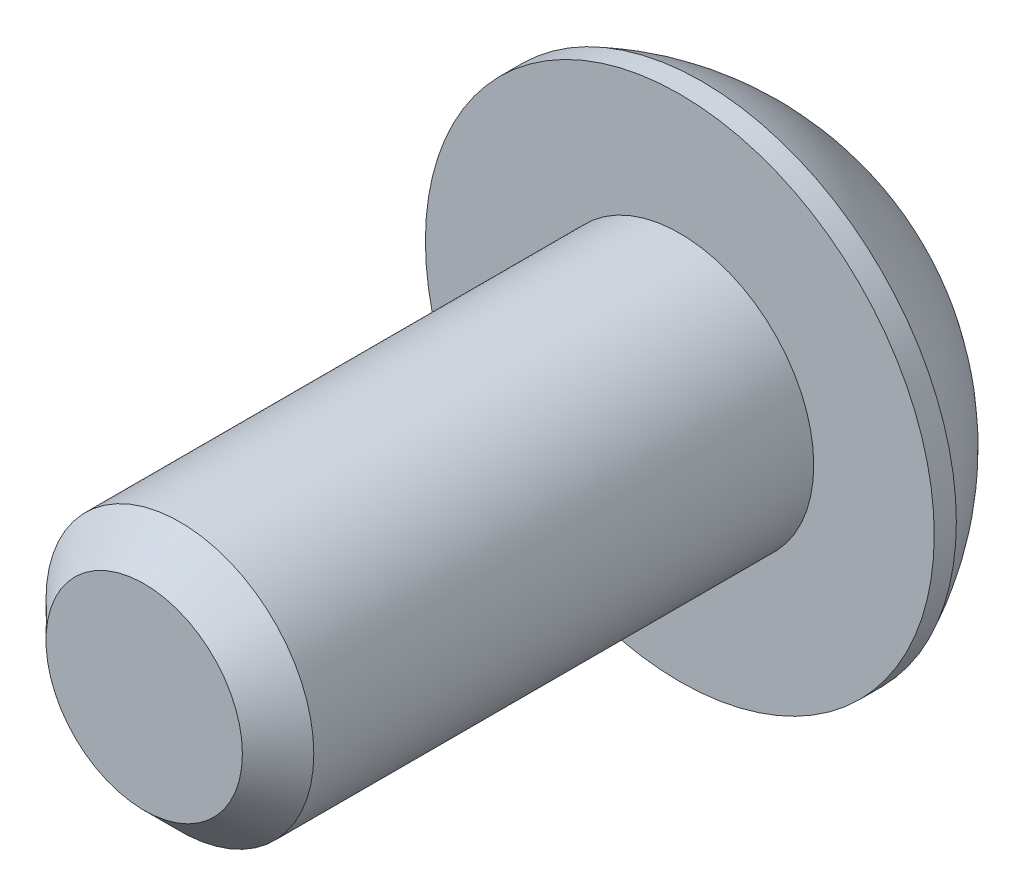
ISO-10303-21;
HEADER;
FILE_DESCRIPTION(('STEP AP214'),'2;1');
FILE_NAME('part.step','',(''),(''),'','','');
FILE_SCHEMA(('AUTOMOTIVE_DESIGN { 1 0 10303 214 1 1 1 1 }'));
ENDSEC;
DATA;
#1=APPLICATION_CONTEXT('core data for automotive mechanical design processes');
#2=APPLICATION_PROTOCOL_DEFINITION('international standard','automotive_design',2000,#1);
#3=PRODUCT_CONTEXT('',#1,'mechanical');
#4=PRODUCT('Part','Part','',(#3));
#5=PRODUCT_RELATED_PRODUCT_CATEGORY('part','',(#4));
#6=PRODUCT_DEFINITION_FORMATION('','',#4);
#7=PRODUCT_DEFINITION_CONTEXT('part definition',#1,'design');
#8=PRODUCT_DEFINITION('design','',#6,#7);
#9=PRODUCT_DEFINITION_SHAPE('','',#8);
#10=(LENGTH_UNIT() NAMED_UNIT(*) SI_UNIT(.MILLI.,.METRE.));
#11=(NAMED_UNIT(*) PLANE_ANGLE_UNIT() SI_UNIT($,.RADIAN.));
#12=(NAMED_UNIT(*) SI_UNIT($,.STERADIAN.) SOLID_ANGLE_UNIT());
#13=UNCERTAINTY_MEASURE_WITH_UNIT(LENGTH_MEASURE(1.E-05),#10,'distance_accuracy_value','');
#14=(GEOMETRIC_REPRESENTATION_CONTEXT(3) GLOBAL_UNCERTAINTY_ASSIGNED_CONTEXT((#13)) GLOBAL_UNIT_ASSIGNED_CONTEXT((#10,
#11,#12)) REPRESENTATION_CONTEXT('',''));
#15=CARTESIAN_POINT('',(0.,0.,0.));
#16=DIRECTION('',(0.,0.,1.));
#17=DIRECTION('',(1.,0.,0.));
#18=AXIS2_PLACEMENT_3D('',#15,#16,#17);
#19=CARTESIAN_POINT('',(0.,0.,-3.825));
#20=DIRECTION('',(0.,0.,1.));
#21=DIRECTION('',(-1.,0.,0.));
#22=AXIS2_PLACEMENT_3D('',#19,#20,#21);
#23=PLANE('',#22);
#24=CARTESIAN_POINT('',(0.,0.,-3.825));
#25=DIRECTION('',(0.,0.,1.));
#26=DIRECTION('',(1.,0.,0.));
#27=AXIS2_PLACEMENT_3D('',#24,#25,#26);
#28=CIRCLE('',#27,1.15470053837925);
#29=CARTESIAN_POINT('',(-1.,0.577350269189626,-3.825));
#30=VERTEX_POINT('',#29);
#31=CARTESIAN_POINT('',(-1.,-0.577350269189626,-3.825));
#32=VERTEX_POINT('',#31);
#33=EDGE_CURVE('E133',#30,#32,#28,.T.);
#34=ORIENTED_EDGE('',*,*,#33,.T.);
#35=CARTESIAN_POINT('',(0.,-1.15470053837925,-3.825));
#36=VERTEX_POINT('',#35);
#37=EDGE_CURVE('E144',#32,#36,#28,.T.);
#38=ORIENTED_EDGE('',*,*,#37,.T.);
#39=CARTESIAN_POINT('',(1.,-0.577350269189626,-3.825));
#40=VERTEX_POINT('',#39);
#41=EDGE_CURVE('E143',#36,#40,#28,.T.);
#42=ORIENTED_EDGE('',*,*,#41,.T.);
#43=CARTESIAN_POINT('',(1.,0.577350269189626,-3.825));
#44=VERTEX_POINT('',#43);
#45=EDGE_CURVE('E138',#40,#44,#28,.T.);
#46=ORIENTED_EDGE('',*,*,#45,.T.);
#47=CARTESIAN_POINT('',(0.,1.15470053837925,-3.825));
#48=VERTEX_POINT('',#47);
#49=EDGE_CURVE('E119',#44,#48,#28,.T.);
#50=ORIENTED_EDGE('',*,*,#49,.T.);
#51=EDGE_CURVE('E128',#48,#30,#28,.T.);
#52=ORIENTED_EDGE('',*,*,#51,.T.);
#53=EDGE_LOOP('',(#34,#38,#42,#46,#50,#52));
#54=FACE_BOUND('',#53,.T.);
#55=CARTESIAN_POINT('',(0.,0.,-3.825));
#56=DIRECTION('',(0.,0.,1.));
#57=DIRECTION('',(1.,0.,0.));
#58=AXIS2_PLACEMENT_3D('',#55,#56,#57);
#59=CIRCLE('',#58,1.5);
#60=CARTESIAN_POINT('',(0.,1.5,-3.825));
#61=VERTEX_POINT('',#60);
#62=EDGE_CURVE('E56',#61,#61,#59,.T.);
#63=ORIENTED_EDGE('',*,*,#62,.F.);
#64=EDGE_LOOP('',(#63));
#65=FACE_BOUND('',#64,.T.);
#66=ADVANCED_FACE('F43',(#54,#65),#23,.F.);
#67=CARTESIAN_POINT('',(0.,0.,-1.03016711229946));
#68=DIRECTION('',(0.,0.,-1.));
#69=DIRECTION('',(0.,1.,0.));
#70=AXIS2_PLACEMENT_3D('',#67,#68,#69);
#71=SPHERICAL_SURFACE('',#70,3.17192226735973);
#72=CARTESIAN_POINT('',(0.,0.,-2.4225));
#73=DIRECTION('',(0.,0.,1.));
#74=DIRECTION('',(1.,0.,0.));
#75=AXIS2_PLACEMENT_3D('',#72,#73,#74);
#76=CIRCLE('',#75,2.85);
#77=CARTESIAN_POINT('',(0.,2.85,-2.4225));
#78=VERTEX_POINT('',#77);
#79=EDGE_CURVE('E241',#78,#78,#76,.T.);
#80=CARTESIAN_POINT('',(0.,1.5,-3.825));
#81=CARTESIAN_POINT('',(0.,1.5181600798921,-3.81525343052663));
#82=CARTESIAN_POINT('',(0.,1.5362251374298,-3.80532981527615));
#83=CARTESIAN_POINT('',(0.,1.57215840256594,-3.78513236887069));
#84=CARTESIAN_POINT('',(0.,1.59002661016438,-3.77485853771571));
#85=CARTESIAN_POINT('',(0.,1.6255593701915,-3.75396453515098));
#86=CARTESIAN_POINT('',(0.,1.64322392262019,-3.74334436374123));
#87=CARTESIAN_POINT('',(0.,1.67834266450262,-3.72176172357303));
#88=CARTESIAN_POINT('',(0.,1.69579685395635,-3.71079925481458));
#89=CARTESIAN_POINT('',(0.,1.73048823664554,-3.68853618336439));
#90=CARTESIAN_POINT('',(0.,1.74772542988098,-3.67723558067265));
#91=CARTESIAN_POINT('',(0.,1.78197627078176,-3.65430053581285));
#92=CARTESIAN_POINT('',(0.,1.79898991844709,-3.64266609364478));
#93=CARTESIAN_POINT('',(0.,1.83278720341135,-3.61906779045309));
#94=CARTESIAN_POINT('',(0.,1.84957084071028,-3.60710392942946));
#95=CARTESIAN_POINT('',(0.,1.88290172764636,-3.58285133450125));
#96=CARTESIAN_POINT('',(0.,1.8994489772835,-3.57056260059666));
#97=CARTESIAN_POINT('',(0.,1.93230080139369,-3.54566492927458));
#98=CARTESIAN_POINT('',(0.,1.94860537586673,-3.53305599185708));
#99=CARTESIAN_POINT('',(0.,1.98096565436365,-3.50752270455889));
#100=CARTESIAN_POINT('',(0.,1.99702135838753,-3.49459835467819));
#101=CARTESIAN_POINT('',(0.,2.02887779526296,-3.46843915334777));
#102=CARTESIAN_POINT('',(0.,2.04467852811452,-3.45520430189805));
#103=CARTESIAN_POINT('',(0.,2.07601901880464,-3.42842912630669));
#104=CARTESIAN_POINT('',(0.,2.09155877664321,-3.41488880216506));
#105=CARTESIAN_POINT('',(0.,2.12237141262985,-3.38750782613789));
#106=CARTESIAN_POINT('',(0.,2.13764429077791,-3.37366717425237));
#107=CARTESIAN_POINT('',(0.,2.16791736411296,-3.34569080180173));
#108=CARTESIAN_POINT('',(0.,2.18291755929993,-3.33155508123663));
#109=CARTESIAN_POINT('',(0.,2.21263956705414,-3.30299394260905));
#110=CARTESIAN_POINT('',(0.,2.22736137962139,-3.28856852454658));
#111=CARTESIAN_POINT('',(0.,2.2565210282552,-3.25943347218353));
#112=CARTESIAN_POINT('',(0.,2.27095886432177,-3.24472383788295));
#113=CARTESIAN_POINT('',(0.,2.2995450739765,-3.21502594229721));
#114=CARTESIAN_POINT('',(0.,2.31369344756465,-3.20003768101205));
#115=CARTESIAN_POINT('',(0.,2.34169535627252,-3.16978822658124));
#116=CARTESIAN_POINT('',(0.,2.35554889139223,-3.15452703343559));
#117=CARTESIAN_POINT('',(0.,2.38295585920366,-3.12373751411442));
#118=CARTESIAN_POINT('',(0.,2.39650929189537,-3.1082091879389));
#119=CARTESIAN_POINT('',(0.,2.42331090492182,-3.07689130289176));
#120=CARTESIAN_POINT('',(0.,2.43655908525656,-3.06110174402014));
#121=CARTESIAN_POINT('',(0.,2.46274515962755,-3.02926739317577));
#122=CARTESIAN_POINT('',(0.,2.47568305366379,-3.01322260120302));
#123=CARTESIAN_POINT('',(0.,2.5012436393965,-2.98088388073287));
#124=CARTESIAN_POINT('',(0.,2.51386633109298,-2.96458995223548));
#125=CARTESIAN_POINT('',(0.,2.53879171587278,-2.9317591499574));
#126=CARTESIAN_POINT('',(0.,2.55109440895612,-2.91522227617672));
#127=CARTESIAN_POINT('',(0.,2.57537512182785,-2.88191186688636));
#128=CARTESIAN_POINT('',(0.,2.58735314161625,-2.8651383313767));
#129=CARTESIAN_POINT('',(0.,2.61097995657956,-2.83136097210575));
#130=CARTESIAN_POINT('',(0.,2.62262875175448,-2.81435714834448));
#131=CARTESIAN_POINT('',(0.,2.64559269128198,-2.78012567355775));
#132=CARTESIAN_POINT('',(0.,2.65690783563458,-2.76289802253229));
#133=CARTESIAN_POINT('',(0.,2.67920017403639,-2.72822543922701));
#134=CARTESIAN_POINT('',(0.,2.69017736808561,-2.71078050694718));
#135=CARTESIAN_POINT('',(0.,2.711789634999,-2.67567998980005));
#136=CARTESIAN_POINT('',(0.,2.72242470786316,-2.65802440493275));
#137=CARTESIAN_POINT('',(0.,2.74334869082117,-2.62250929096058));
#138=CARTESIAN_POINT('',(0.,2.75363760091502,-2.60464976185571));
#139=CARTESIAN_POINT('',(0.,2.77386535089241,-2.56873354659176));
#140=CARTESIAN_POINT('',(0.,2.78380419077596,-2.55067686043268));
#141=CARTESIAN_POINT('',(0.,2.80332801615778,-2.51437318815589));
#142=CARTESIAN_POINT('',(0.,2.81291300165605,-2.49612620203818));
#143=CARTESIAN_POINT('',(0.,2.83172550494215,-2.4594488779161));
#144=CARTESIAN_POINT('',(0.,2.84095302272998,-2.44101853991173));
#145=CARTESIAN_POINT('',(0.,2.85,-2.4225));
#146=B_SPLINE_CURVE_WITH_KNOTS('',3,(#80,#81,#82,#83,#84,#85,#86,#87,#88,#89,#90,#91,#92,#93,
#94,#95,#96,#97,#98,#99,#100,#101,#102,#103,#104,#105,#106,#107,#108,#109,#110,#111,#112,#113,
#114,#115,#116,#117,#118,#119,#120,#121,#122,#123,#124,#125,#126,#127,#128,#129,#130,#131,#132,
#133,#134,#135,#136,#137,#138,#139,#140,#141,#142,#143,#144,#145),.UNSPECIFIED.,.F.,.F.,(4,2,2,
2,2,2,2,2,2,2,2,2,2,2,2,2,2,2,2,2,2,2,2,2,2,2,2,2,2,2,2,2,4),(0.,0.0618298941826979,
0.123659788365397,0.185489682548095,0.247319576730793,0.309149470913491,0.370979365096189,
0.432809259278888,0.494639153461586,0.556469047644284,0.618298941826983,0.680128836009681,
0.741958730192379,0.803788624375077,0.865618518557776,0.927448412740474,0.989278306923172,
1.05110820110587,1.11293809528857,1.17476798947127,1.23659788365397,1.29842777783666,
1.36025767201936,1.42208756620206,1.48391746038476,1.54574735456746,1.60757724875015,
1.66940714293285,1.73123703711555,1.79306693129825,1.85489682548095,1.91672671966365,
1.97855661384634),.UNSPECIFIED.);
#147=EDGE_CURVE('BSEAM229',#61,#78,#146,.T.);
#148=ORIENTED_EDGE('',*,*,#62,.T.);
#149=ORIENTED_EDGE('',*,*,#79,.F.);
#150=ORIENTED_EDGE('',*,*,#147,.T.);
#151=ORIENTED_EDGE('',*,*,#147,.F.);
#152=EDGE_LOOP('',(#148,#150,#149,#151));
#153=FACE_BOUND('',#152,.T.);
#154=ADVANCED_FACE('F229',(#153),#71,.T.);
#155=CARTESIAN_POINT('',(0.,0.,-3.825));
#156=DIRECTION('',(0.,0.,-1.));
#157=DIRECTION('',(1.,0.,0.));
#158=AXIS2_PLACEMENT_3D('',#155,#156,#157);
#159=CYLINDRICAL_SURFACE('',#158,2.85);
#160=ORIENTED_EDGE('',*,*,#79,.T.);
#161=EDGE_LOOP('',(#160));
#162=FACE_BOUND('',#161,.T.);
#163=CARTESIAN_POINT('',(0.,0.,-2.175));
#164=DIRECTION('',(0.,0.,1.));
#165=DIRECTION('',(1.,0.,0.));
#166=AXIS2_PLACEMENT_3D('',#163,#164,#165);
#167=CIRCLE('',#166,2.85);
#168=CARTESIAN_POINT('',(2.85,0.,-2.175));
#169=VERTEX_POINT('',#168);
#170=EDGE_CURVE('E242',#169,#169,#167,.T.);
#171=ORIENTED_EDGE('',*,*,#170,.F.);
#172=EDGE_LOOP('',(#171));
#173=FACE_BOUND('',#172,.T.);
#174=ADVANCED_FACE('F226',(#162,#173),#159,.T.);
#175=CARTESIAN_POINT('',(0.,1.5,-2.175));
#176=DIRECTION('',(0.,0.,-1.));
#177=DIRECTION('',(1.,0.,0.));
#178=AXIS2_PLACEMENT_3D('',#175,#176,#177);
#179=PLANE('',#178);
#180=ORIENTED_EDGE('',*,*,#170,.T.);
#181=EDGE_LOOP('',(#180));
#182=FACE_BOUND('',#181,.T.);
#183=CARTESIAN_POINT('',(0.,0.,-2.175));
#184=DIRECTION('',(0.,0.,1.));
#185=DIRECTION('',(1.,0.,0.));
#186=AXIS2_PLACEMENT_3D('',#183,#184,#185);
#187=CIRCLE('',#186,1.5);
#188=CARTESIAN_POINT('',(1.5,0.,-2.175));
#189=VERTEX_POINT('',#188);
#190=EDGE_CURVE('E245',#189,#189,#187,.T.);
#191=ORIENTED_EDGE('',*,*,#190,.F.);
#192=EDGE_LOOP('',(#191));
#193=FACE_BOUND('',#192,.T.);
#194=ADVANCED_FACE('F222',(#182,#193),#179,.F.);
#195=CARTESIAN_POINT('',(0.,0.,-3.825));
#196=DIRECTION('',(0.,0.,-1.));
#197=DIRECTION('',(1.,0.,0.));
#198=AXIS2_PLACEMENT_3D('',#195,#196,#197);
#199=CYLINDRICAL_SURFACE('',#198,1.5);
#200=ORIENTED_EDGE('',*,*,#190,.T.);
#201=EDGE_LOOP('',(#200));
#202=FACE_BOUND('',#201,.T.);
#203=CARTESIAN_POINT('',(0.,0.,3.425));
#204=DIRECTION('',(0.,0.,1.));
#205=DIRECTION('',(1.,0.,0.));
#206=AXIS2_PLACEMENT_3D('',#203,#204,#205);
#207=CIRCLE('',#206,1.5);
#208=CARTESIAN_POINT('',(1.5,0.,3.425));
#209=VERTEX_POINT('',#208);
#210=EDGE_CURVE('E250',#209,#209,#207,.T.);
#211=ORIENTED_EDGE('',*,*,#210,.F.);
#212=EDGE_LOOP('',(#211));
#213=FACE_BOUND('',#212,.T.);
#214=ADVANCED_FACE('F218',(#202,#213),#199,.T.);
#215=CARTESIAN_POINT('',(0.,0.,3.825));
#216=DIRECTION('',(0.,0.,-1.));
#217=DIRECTION('',(1.,0.,0.));
#218=AXIS2_PLACEMENT_3D('',#215,#216,#217);
#219=CONICAL_SURFACE('',#218,1.1,0.785398163397444);
#220=ORIENTED_EDGE('',*,*,#210,.T.);
#221=EDGE_LOOP('',(#220));
#222=FACE_BOUND('',#221,.T.);
#223=CARTESIAN_POINT('',(0.,0.,3.825));
#224=DIRECTION('',(0.,0.,1.));
#225=DIRECTION('',(1.,0.,0.));
#226=AXIS2_PLACEMENT_3D('',#223,#224,#225);
#227=CIRCLE('',#226,1.1);
#228=CARTESIAN_POINT('',(1.1,0.,3.825));
#229=VERTEX_POINT('',#228);
#230=EDGE_CURVE('E253',#229,#229,#227,.T.);
#231=ORIENTED_EDGE('',*,*,#230,.F.);
#232=EDGE_LOOP('',(#231));
#233=FACE_BOUND('',#232,.T.);
#234=ADVANCED_FACE('F214',(#222,#233),#219,.T.);
#235=CARTESIAN_POINT('',(0.,0.,3.825));
#236=DIRECTION('',(0.,0.,-1.));
#237=DIRECTION('',(1.,0.,0.));
#238=AXIS2_PLACEMENT_3D('',#235,#236,#237);
#239=PLANE('',#238);
#240=ORIENTED_EDGE('',*,*,#230,.T.);
#241=EDGE_LOOP('',(#240));
#242=FACE_BOUND('',#241,.T.);
#243=ADVANCED_FACE('F211',(#242),#239,.F.);
#244=CARTESIAN_POINT('',(0.,0.,-3.825));
#245=DIRECTION('',(0.,0.,-1.));
#246=DIRECTION('',(1.,0.,0.));
#247=AXIS2_PLACEMENT_3D('',#244,#245,#246);
#248=CONICAL_SURFACE('',#247,1.15470053837925,0.78539816339745);
#249=ORIENTED_EDGE('',*,*,#51,.F.);
#250=CARTESIAN_POINT('',(0.000200000000000047,1.15481600843309,-3.82511548737261));
#251=CARTESIAN_POINT('',(-0.0341825950071806,1.13496520795026,-3.80527793082573));
#252=CARTESIAN_POINT('',(-0.0691401181398248,1.11478247255942,-3.78660502063889));
#253=CARTESIAN_POINT('',(-0.14042280295609,1.07362739529219,-3.75241474272316));
#254=CARTESIAN_POINT('',(-0.176754750528984,1.0526511355808,-3.73691640902346));
#255=CARTESIAN_POINT('',(-0.250016613803311,1.01035337909803,-3.71036730714226));
#256=CARTESIAN_POINT('',(-0.286927851445414,0.989042666109241,-3.69924977399692));
#257=CARTESIAN_POINT('',(-0.361562729310859,0.945952199282692,-3.68211986577618));
#258=CARTESIAN_POINT('',(-0.399284088108636,0.924173762626597,-3.67609469746667));
#259=CARTESIAN_POINT('',(-0.464292198417934,0.886641312640015,-3.67066055496749));
#260=CARTESIAN_POINT('',(-0.491494371528172,0.870936130672276,-3.66985693831673));
#261=CARTESIAN_POINT('',(-0.545846040669112,0.839556179862849,-3.67120669941689));
#262=CARTESIAN_POINT('',(-0.572995523754876,0.823881418494924,-3.6733607295472));
#263=CARTESIAN_POINT('',(-0.65405627732696,0.777080970599367,-3.68411697212847));
#264=CARTESIAN_POINT('',(-0.707564140978427,0.746188191116431,-3.69701455641535));
#265=CARTESIAN_POINT('',(-0.801476065143432,0.69196811641965,-3.72814073060218));
#266=CARTESIAN_POINT('',(-0.842320523671834,0.668386557293372,-3.74473779770184));
#267=CARTESIAN_POINT('',(-0.922409637381944,0.622147085933682,-3.78212492468529));
#268=CARTESIAN_POINT('',(-0.961659010870438,0.599486449584576,-3.8029013418174));
#269=CARTESIAN_POINT('',(-1.0002,0.577234799135789,-3.82511548737261));
#270=B_SPLINE_CURVE_WITH_KNOTS('',3,(#250,#251,#252,#253,#254,#255,#256,#257,#258,#259,#260,
#261,#262,#263,#264,#265,#266,#267,#268,#269),.UNSPECIFIED.,.F.,.F.,(4,2,2,2,2,2,2,2,2,4),(0.,
0.133237676828559,0.26725222983449,0.3991370762693,0.530689603280768,0.624814864263846,
0.718960890149133,0.907306626112098,1.05710100361789,1.20641411519286),.UNSPECIFIED.);
#271=EDGE_CURVE('E11',#48,#30,#270,.T.);
#272=ORIENTED_EDGE('',*,*,#271,.T.);
#273=EDGE_LOOP('',(#249,#272));
#274=FACE_BOUND('',#273,.T.);
#275=ADVANCED_FACE('F129',(#274),#248,.F.);
#276=ORIENTED_EDGE('',*,*,#33,.F.);
#277=CARTESIAN_POINT('',(-1.,-1.15147208646462,-4.19538567751386));
#278=CARTESIAN_POINT('',(-1.,-1.12343447988552,-4.17421991987371));
#279=CARTESIAN_POINT('',(-1.,-1.09524064850697,-4.15326169217591));
#280=CARTESIAN_POINT('',(-1.,-1.03847715644376,-4.11184602223562));
#281=CARTESIAN_POINT('',(-1.,-1.00990740382975,-4.09138870612366));
#282=CARTESIAN_POINT('',(-1.,-0.923120894333476,-4.03060479495451));
#283=CARTESIAN_POINT('',(-1.,-0.864253173759059,-3.9911922289614));
#284=CARTESIAN_POINT('',(-1.,-0.740809858258045,-3.9138206642002));
#285=CARTESIAN_POINT('',(-1.,-0.676100255137807,-3.87607303911434));
#286=CARTESIAN_POINT('',(-1.,-0.543448939049124,-3.80702458755129));
#287=CARTESIAN_POINT('',(-1.,-0.475519112027779,-3.77570202784686));
#288=CARTESIAN_POINT('',(-1.,-0.373555850333528,-3.73738177888379));
#289=CARTESIAN_POINT('',(-1.,-0.341031989670907,-3.72638359164215));
#290=CARTESIAN_POINT('',(-1.,-0.275199079052293,-3.70699834214736));
#291=CARTESIAN_POINT('',(-1.,-0.241889975173933,-3.6986114597767));
#292=CARTESIAN_POINT('',(-1.,-0.175247517042992,-3.68502522071901));
#293=CARTESIAN_POINT('',(-1.,-0.141925568218175,-3.67977079076797));
#294=CARTESIAN_POINT('',(-1.,-0.0749144362322788,-3.67254868657089));
#295=CARTESIAN_POINT('',(-1.,-0.0412251978501616,-3.67058151361051));
#296=CARTESIAN_POINT('',(-1.,0.0249580992634211,-3.67008319839316));
#297=CARTESIAN_POINT('',(-1.,0.0574512826460393,-3.67143026788863));
#298=CARTESIAN_POINT('',(-1.,0.122148505701867,-3.67721648449898));
#299=CARTESIAN_POINT('',(-1.,0.154352610132926,-3.68165492066153));
#300=CARTESIAN_POINT('',(-1.,0.21879989886764,-3.6934568301452));
#301=CARTESIAN_POINT('',(-1.,0.251033743268953,-3.70087054103851));
#302=CARTESIAN_POINT('',(-1.,0.314797132354919,-3.71822894249867));
#303=CARTESIAN_POINT('',(-1.,0.346326735731004,-3.72817342128883));
#304=CARTESIAN_POINT('',(-1.,0.445594187730205,-3.76322348255433));
#305=CARTESIAN_POINT('',(-1.,0.511919139476036,-3.79232085835672));
#306=CARTESIAN_POINT('',(-1.,0.641453244657532,-3.8570153296865));
#307=CARTESIAN_POINT('',(-1.,0.704650133126344,-3.89263577671524));
#308=CARTESIAN_POINT('',(-1.,0.825428490174986,-3.96612390134693));
#309=CARTESIAN_POINT('',(-1.,0.883132947867684,-4.00379194713546));
#310=CARTESIAN_POINT('',(-1.,0.968148853704564,-4.06202285294316));
#311=CARTESIAN_POINT('',(-1.,0.996120570380284,-4.08163847576285));
#312=CARTESIAN_POINT('',(-1.,1.05168177729901,-4.12138851706127));
#313=CARTESIAN_POINT('',(-1.,1.079271369977,-4.14152279219883));
#314=CARTESIAN_POINT('',(-1.,1.10670185346329,-4.16187211907297));
#315=B_SPLINE_CURVE_WITH_KNOTS('',3,(#277,#278,#279,#280,#281,#282,#283,#284,#285,#286,#287,
#288,#289,#290,#291,#292,#293,#294,#295,#296,#297,#298,#299,#300,#301,#302,#303,#304,#305,#306,
#307,#308,#309,#310,#311,#312,#313,#314),.UNSPECIFIED.,.F.,.F.,(4,2,2,2,2,2,2,2,2,2,2,2,2,2,2,2,
2,2,4),(0.,0.105386459083291,0.210799187330124,0.423233611565468,0.647793540908503,
0.871580877738609,0.974493074181421,1.07741235827201,1.17846428203205,1.27953161415762,
1.3769408673961,1.47432772585408,1.57343322804293,1.67253043972851,1.88917353996827,
2.10660791038813,2.31323734249843,2.41572589232044,2.51818641476503),.UNSPECIFIED.);
#316=EDGE_CURVE('E139',#30,#32,#315,.F.);
#317=ORIENTED_EDGE('',*,*,#316,.T.);
#318=EDGE_LOOP('',(#276,#317));
#319=FACE_BOUND('',#318,.T.);
#320=ADVANCED_FACE('F149',(#319),#248,.F.);
#321=ORIENTED_EDGE('',*,*,#37,.F.);
#322=CARTESIAN_POINT('',(-1.0002,-0.577234799135788,-3.82511548737261));
#323=CARTESIAN_POINT('',(-0.965817404992819,-0.597085599618621,-3.80527793082573));
#324=CARTESIAN_POINT('',(-0.930859881860175,-0.617268335009456,-3.78660502063889));
#325=CARTESIAN_POINT('',(-0.85957719704391,-0.658423412276686,-3.75241474272316));
#326=CARTESIAN_POINT('',(-0.823245249471016,-0.67939967198808,-3.73691640902346));
#327=CARTESIAN_POINT('',(-0.749983386196689,-0.721697428470846,-3.71036730714226));
#328=CARTESIAN_POINT('',(-0.713072148554586,-0.743008141459636,-3.69924977399692));
#329=CARTESIAN_POINT('',(-0.638437270689141,-0.786098608286186,-3.68211986577618));
#330=CARTESIAN_POINT('',(-0.600715911891364,-0.807877044942281,-3.67609469746667));
#331=CARTESIAN_POINT('',(-0.535707801582067,-0.845409494928862,-3.67066055496749));
#332=CARTESIAN_POINT('',(-0.508505628471828,-0.861114676896601,-3.66985693831673));
#333=CARTESIAN_POINT('',(-0.454153959330888,-0.892494627706028,-3.67120669941689));
#334=CARTESIAN_POINT('',(-0.427004476245125,-0.908169389073953,-3.6733607295472));
#335=CARTESIAN_POINT('',(-0.34594372267304,-0.95496983696951,-3.68411697212847));
#336=CARTESIAN_POINT('',(-0.292435859021573,-0.985862616452447,-3.69701455641535));
#337=CARTESIAN_POINT('',(-0.198523934856569,-1.04008269114923,-3.72814073060218));
#338=CARTESIAN_POINT('',(-0.157679476328166,-1.06366425027551,-3.74473779770184));
#339=CARTESIAN_POINT('',(-0.0775903626180565,-1.1099037216352,-3.78212492468529));
#340=CARTESIAN_POINT('',(-0.0383409891295625,-1.1325643579843,-3.8029013418174));
#341=CARTESIAN_POINT('',(0.000199999999999785,-1.15481600843309,-3.82511548737261));
#342=B_SPLINE_CURVE_WITH_KNOTS('',3,(#322,#323,#324,#325,#326,#327,#328,#329,#330,#331,#332,
#333,#334,#335,#336,#337,#338,#339,#340,#341),.UNSPECIFIED.,.F.,.F.,(4,2,2,2,2,2,2,2,2,4),(0.,
0.133237676828559,0.26725222983449,0.3991370762693,0.530689603280768,0.624814864263846,
0.718960890149133,0.907306626112097,1.05710100361789,1.20641411519286),.UNSPECIFIED.);
#343=EDGE_CURVE('E141',#32,#36,#342,.T.);
#344=ORIENTED_EDGE('',*,*,#343,.T.);
#345=EDGE_LOOP('',(#321,#344));
#346=FACE_BOUND('',#345,.T.);
#347=ADVANCED_FACE('F153',(#346),#248,.F.);
#348=ORIENTED_EDGE('',*,*,#41,.F.);
#349=CARTESIAN_POINT('',(-0.000200000000000145,-1.15481600843309,-3.82511548737261));
#350=CARTESIAN_POINT('',(0.0341825950071805,-1.13496520795026,-3.80527793082573));
#351=CARTESIAN_POINT('',(0.0691401181398246,-1.11478247255942,-3.78660502063889));
#352=CARTESIAN_POINT('',(0.140422802956089,-1.07362739529219,-3.75241474272316));
#353=CARTESIAN_POINT('',(0.176754750528984,-1.0526511355808,-3.73691640902346));
#354=CARTESIAN_POINT('',(0.250016613803311,-1.01035337909803,-3.71036730714226));
#355=CARTESIAN_POINT('',(0.286927851445414,-0.98904266610924,-3.69924977399692));
#356=CARTESIAN_POINT('',(0.361562729310859,-0.945952199282691,-3.68211986577618));
#357=CARTESIAN_POINT('',(0.399284088108636,-0.924173762626596,-3.67609469746667));
#358=CARTESIAN_POINT('',(0.464292198417933,-0.886641312640014,-3.67066055496749));
#359=CARTESIAN_POINT('',(0.491494371528172,-0.870936130672275,-3.66985693831673));
#360=CARTESIAN_POINT('',(0.545846040669112,-0.839556179862848,-3.67120669941689));
#361=CARTESIAN_POINT('',(0.572995523754876,-0.823881418494923,-3.6733607295472));
#362=CARTESIAN_POINT('',(0.65405627732696,-0.777080970599366,-3.68411697212847));
#363=CARTESIAN_POINT('',(0.707564140978427,-0.74618819111643,-3.69701455641535));
#364=CARTESIAN_POINT('',(0.801476065143431,-0.691968116419649,-3.72814073060218));
#365=CARTESIAN_POINT('',(0.842320523671834,-0.668386557293371,-3.74473779770184));
#366=CARTESIAN_POINT('',(0.922409637381944,-0.622147085933681,-3.78212492468529));
#367=CARTESIAN_POINT('',(0.961659010870438,-0.599486449584575,-3.8029013418174));
#368=CARTESIAN_POINT('',(1.0002,-0.577234799135788,-3.82511548737261));
#369=B_SPLINE_CURVE_WITH_KNOTS('',3,(#349,#350,#351,#352,#353,#354,#355,#356,#357,#358,#359,
#360,#361,#362,#363,#364,#365,#366,#367,#368),.UNSPECIFIED.,.F.,.F.,(4,2,2,2,2,2,2,2,2,4),(0.,
0.133237676828559,0.26725222983449,0.3991370762693,0.530689603280768,0.624814864263846,
0.718960890149133,0.907306626112097,1.05710100361789,1.20641411519286),.UNSPECIFIED.);
#370=EDGE_CURVE('E156',#36,#40,#369,.T.);
#371=ORIENTED_EDGE('',*,*,#370,.T.);
#372=EDGE_LOOP('',(#348,#371));
#373=FACE_BOUND('',#372,.T.);
#374=ADVANCED_FACE('F160',(#373),#248,.F.);
#375=ORIENTED_EDGE('',*,*,#45,.F.);
#376=CARTESIAN_POINT('',(1.,-1.15147208663215,-4.19538567764035));
#377=CARTESIAN_POINT('',(1.,-1.12343448004835,-4.17421991999533));
#378=CARTESIAN_POINT('',(1.,-1.09524064866509,-4.15326169229266));
#379=CARTESIAN_POINT('',(1.,-1.0384771565924,-4.11184602234267));
#380=CARTESIAN_POINT('',(1.,-1.00990740397363,-4.09138870622588));
#381=CARTESIAN_POINT('',(1.,-0.923120894462775,-4.03060479504212));
#382=CARTESIAN_POINT('',(1.,-0.864253173878445,-3.99119222903932));
#383=CARTESIAN_POINT('',(1.,-0.740809858355811,-3.91382066425819));
#384=CARTESIAN_POINT('',(1.,-0.676100255223808,-3.87607303916216));
#385=CARTESIAN_POINT('',(1.,-0.543448939110597,-3.80702458758025));
#386=CARTESIAN_POINT('',(1.,-0.475519112076495,-3.77570202786713));
#387=CARTESIAN_POINT('',(1.,-0.373555850372648,-3.7373817788976));
#388=CARTESIAN_POINT('',(1.,-0.341031989714046,-3.72638359165621));
#389=CARTESIAN_POINT('',(1.,-0.275199079103601,-3.70699834216111));
#390=CARTESIAN_POINT('',(1.,-0.241889975229392,-3.69861145978989));
#391=CARTESIAN_POINT('',(1.,-0.175247517106615,-3.68502522073014));
#392=CARTESIAN_POINT('',(1.,-0.141925568285808,-3.67977079077761));
#393=CARTESIAN_POINT('',(1.,-0.0749144363078009,-3.67254868657667));
#394=CARTESIAN_POINT('',(1.,-0.0412251979295626,-3.6705815136139));
#395=CARTESIAN_POINT('',(1.,0.0249580991768645,-3.67008319839111));
#396=CARTESIAN_POINT('',(1.,0.057451282556196,-3.67143026788357));
#397=CARTESIAN_POINT('',(1.,0.122148505605779,-3.67721648448742));
#398=CARTESIAN_POINT('',(1.,0.154352610033881,-3.68165492064648));
#399=CARTESIAN_POINT('',(1.,0.218799898762755,-3.69345683012285));
#400=CARTESIAN_POINT('',(1.,0.251033743161196,-3.70087054101231));
#401=CARTESIAN_POINT('',(1.,0.314797132241694,-3.71822894246471));
#402=CARTESIAN_POINT('',(1.,0.346326735615184,-3.72817342125094));
#403=CARTESIAN_POINT('',(1.,0.445594187589164,-3.76322348249794));
#404=CARTESIAN_POINT('',(1.,0.511919139313635,-3.7923208582833));
#405=CARTESIAN_POINT('',(1.,0.641453244454049,-3.85701532957714));
#406=CARTESIAN_POINT('',(1.,0.704650132903151,-3.89263577658696));
#407=CARTESIAN_POINT('',(1.,0.825428489916356,-3.96612390118245));
#408=CARTESIAN_POINT('',(1.,0.883132947593201,-4.00379194695385));
#409=CARTESIAN_POINT('',(1.,0.968148853406642,-4.06202285273595));
#410=CARTESIAN_POINT('',(1.,0.99612057007466,-4.08163847554718));
#411=CARTESIAN_POINT('',(1.,1.05168177697804,-4.12138851682867));
#412=CARTESIAN_POINT('',(1.,1.07927136964838,-4.14152279195778));
#413=CARTESIAN_POINT('',(1.,1.10670185312703,-4.16187211882347));
#414=B_SPLINE_CURVE_WITH_KNOTS('',3,(#376,#377,#378,#379,#380,#381,#382,#383,#384,#385,#386,
#387,#388,#389,#390,#391,#392,#393,#394,#395,#396,#397,#398,#399,#400,#401,#402,#403,#404,#405,
#406,#407,#408,#409,#410,#411,#412,#413),.UNSPECIFIED.,.F.,.F.,(4,2,2,2,2,2,2,2,2,2,2,2,2,2,2,2,
2,2,4),(0.,0.10538645910335,0.210799187370248,0.423233611646473,0.64779354103535,
0.871580877910865,0.974493074342054,1.07741235842104,1.17846428216995,1.27953161428439,
1.37694086751269,1.47432772596047,1.57343322813835,1.67253043981296,1.88917353997386,
2.10660791031433,2.31323734235672,2.41572589214523,2.51818641455632),.UNSPECIFIED.);
#415=EDGE_CURVE('E121',#40,#44,#414,.T.);
#416=ORIENTED_EDGE('',*,*,#415,.T.);
#417=EDGE_LOOP('',(#375,#416));
#418=FACE_BOUND('',#417,.T.);
#419=ADVANCED_FACE('F163',(#418),#248,.F.);
#420=ORIENTED_EDGE('',*,*,#49,.F.);
#421=CARTESIAN_POINT('',(1.0002,0.577234799135789,-3.82511548737261));
#422=CARTESIAN_POINT('',(0.965817404992819,0.597085599618622,-3.80527793082573));
#423=CARTESIAN_POINT('',(0.930859881860175,0.617268335009457,-3.78660502063889));
#424=CARTESIAN_POINT('',(0.859577197043911,0.658423412276686,-3.75241474272316));
#425=CARTESIAN_POINT('',(0.823245249471016,0.67939967198808,-3.73691640902346));
#426=CARTESIAN_POINT('',(0.749983386196689,0.721697428470847,-3.71036730714226));
#427=CARTESIAN_POINT('',(0.713072148554586,0.743008141459637,-3.69924977399693));
#428=CARTESIAN_POINT('',(0.638437270689141,0.786098608286186,-3.68211986577618));
#429=CARTESIAN_POINT('',(0.600715911891365,0.807877044942281,-3.67609469746667));
#430=CARTESIAN_POINT('',(0.535707801582067,0.845409494928863,-3.67066055496749));
#431=CARTESIAN_POINT('',(0.508505628471829,0.861114676896602,-3.66985693831673));
#432=CARTESIAN_POINT('',(0.454153959330889,0.892494627706029,-3.67120669941689));
#433=CARTESIAN_POINT('',(0.427004476245125,0.908169389073954,-3.6733607295472));
#434=CARTESIAN_POINT('',(0.34594372267304,0.954969836969511,-3.68411697212847));
#435=CARTESIAN_POINT('',(0.292435859021573,0.985862616452447,-3.69701455641535));
#436=CARTESIAN_POINT('',(0.198523934856569,1.04008269114923,-3.72814073060218));
#437=CARTESIAN_POINT('',(0.157679476328166,1.06366425027551,-3.74473779770184));
#438=CARTESIAN_POINT('',(0.0775903626180566,1.1099037216352,-3.78212492468529));
#439=CARTESIAN_POINT('',(0.0383409891295624,1.1325643579843,-3.8029013418174));
#440=CARTESIAN_POINT('',(-0.000199999999999812,1.15481600843309,-3.82511548737261));
#441=B_SPLINE_CURVE_WITH_KNOTS('',3,(#421,#422,#423,#424,#425,#426,#427,#428,#429,#430,#431,
#432,#433,#434,#435,#436,#437,#438,#439,#440),.UNSPECIFIED.,.F.,.F.,(4,2,2,2,2,2,2,2,2,4),(0.,
0.133237676828559,0.267252229834489,0.399137076269299,0.530689603280767,0.624814864263845,
0.718960890149132,0.907306626112096,1.05710100361789,1.20641411519286),.UNSPECIFIED.);
#442=EDGE_CURVE('E104',#44,#48,#441,.T.);
#443=ORIENTED_EDGE('',*,*,#442,.T.);
#444=EDGE_LOOP('',(#420,#443));
#445=FACE_BOUND('',#444,.T.);
#446=ADVANCED_FACE('F117',(#445),#248,.F.);
#447=CARTESIAN_POINT('',(0.,0.,-2.425));
#448=DIRECTION('',(0.,0.,-1.));
#449=DIRECTION('',(1.,0.,0.));
#450=AXIS2_PLACEMENT_3D('',#447,#448,#449);
#451=PLANE('',#450);
#452=DIRECTION('',(-0.866025403784439,0.5,0.));
#453=VECTOR('',#452,1.);
#454=CARTESIAN_POINT('',(1.,0.577350269189626,-2.425));
#455=LINE('',#454,#453);
#456=CARTESIAN_POINT('',(1.,0.577350269189626,-2.425));
#457=VERTEX_POINT('',#456);
#458=CARTESIAN_POINT('',(0.,1.15470053837925,-2.425));
#459=VERTEX_POINT('',#458);
#460=EDGE_CURVE('E107',#457,#459,#455,.T.);
#461=ORIENTED_EDGE('',*,*,#460,.F.);
#462=DIRECTION('',(0.,1.,0.));
#463=VECTOR('',#462,1.);
#464=CARTESIAN_POINT('',(1.,-0.577350269189626,-2.425));
#465=LINE('',#464,#463);
#466=CARTESIAN_POINT('',(1.,-0.577350269189626,-2.425));
#467=VERTEX_POINT('',#466);
#468=EDGE_CURVE('E113',#467,#457,#465,.T.);
#469=ORIENTED_EDGE('',*,*,#468,.F.);
#470=DIRECTION('',(0.866025403784439,0.5,0.));
#471=VECTOR('',#470,1.);
#472=CARTESIAN_POINT('',(0.,-1.15470053837925,-2.425));
#473=LINE('',#472,#471);
#474=CARTESIAN_POINT('',(0.,-1.15470053837925,-2.425));
#475=VERTEX_POINT('',#474);
#476=EDGE_CURVE('E264',#475,#467,#473,.T.);
#477=ORIENTED_EDGE('',*,*,#476,.F.);
#478=DIRECTION('',(0.866025403784438,-0.5,0.));
#479=VECTOR('',#478,1.);
#480=CARTESIAN_POINT('',(-1.,-0.577350269189625,-2.425));
#481=LINE('',#480,#479);
#482=CARTESIAN_POINT('',(-1.,-0.577350269189625,-2.425));
#483=VERTEX_POINT('',#482);
#484=EDGE_CURVE('E266',#483,#475,#481,.T.);
#485=ORIENTED_EDGE('',*,*,#484,.F.);
#486=DIRECTION('',(0.,-1.,0.));
#487=VECTOR('',#486,1.);
#488=CARTESIAN_POINT('',(-1.,0.577350269189626,-2.425));
#489=LINE('',#488,#487);
#490=CARTESIAN_POINT('',(-1.,0.577350269189626,-2.425));
#491=VERTEX_POINT('',#490);
#492=EDGE_CURVE('E269',#491,#483,#489,.T.);
#493=ORIENTED_EDGE('',*,*,#492,.F.);
#494=DIRECTION('',(-0.866025403784439,-0.5,0.));
#495=VECTOR('',#494,1.);
#496=CARTESIAN_POINT('',(0.,1.15470053837925,-2.425));
#497=LINE('',#496,#495);
#498=EDGE_CURVE('E272',#459,#491,#497,.T.);
#499=ORIENTED_EDGE('',*,*,#498,.F.);
#500=EDGE_LOOP('',(#461,#469,#477,#485,#493,#499));
#501=FACE_BOUND('',#500,.T.);
#502=ADVANCED_FACE('F187',(#501),#451,.T.);
#503=CARTESIAN_POINT('',(0.,1.15470053837925,-2.425));
#504=DIRECTION('',(-0.5,0.866025403784439,0.));
#505=DIRECTION('',(-0.866025403784439,-0.5,0.));
#506=AXIS2_PLACEMENT_3D('',#503,#504,#505);
#507=PLANE('',#506);
#508=DIRECTION('',(0.,0.,-1.));
#509=VECTOR('',#508,1.);
#510=CARTESIAN_POINT('',(0.,1.15470053837925,-2.425));
#511=LINE('',#510,#509);
#512=EDGE_CURVE('E101',#459,#48,#511,.T.);
#513=ORIENTED_EDGE('',*,*,#512,.F.);
#514=ORIENTED_EDGE('',*,*,#498,.T.);
#515=DIRECTION('',(0.,0.,-1.));
#516=VECTOR('',#515,1.);
#517=CARTESIAN_POINT('',(-1.,0.577350269189626,-2.425));
#518=LINE('',#517,#516);
#519=EDGE_CURVE('E112',#491,#30,#518,.T.);
#520=ORIENTED_EDGE('',*,*,#519,.T.);
#521=ORIENTED_EDGE('',*,*,#271,.F.);
#522=EDGE_LOOP('',(#513,#514,#520,#521));
#523=FACE_BOUND('',#522,.T.);
#524=ADVANCED_FACE('F124',(#523),#507,.F.);
#525=CARTESIAN_POINT('',(-1.,0.577350269189626,-2.425));
#526=DIRECTION('',(-1.,0.,0.));
#527=DIRECTION('',(0.,0.,-1.));
#528=AXIS2_PLACEMENT_3D('',#525,#526,#527);
#529=PLANE('',#528);
#530=ORIENTED_EDGE('',*,*,#519,.F.);
#531=ORIENTED_EDGE('',*,*,#492,.T.);
#532=DIRECTION('',(0.,0.,-1.));
#533=VECTOR('',#532,1.);
#534=CARTESIAN_POINT('',(-1.,-0.577350269189625,-2.425));
#535=LINE('',#534,#533);
#536=EDGE_CURVE('E257',#483,#32,#535,.T.);
#537=ORIENTED_EDGE('',*,*,#536,.T.);
#538=ORIENTED_EDGE('',*,*,#316,.F.);
#539=EDGE_LOOP('',(#530,#531,#537,#538));
#540=FACE_BOUND('',#539,.T.);
#541=ADVANCED_FACE('F195',(#540),#529,.F.);
#542=CARTESIAN_POINT('',(-1.,-0.577350269189625,-2.425));
#543=DIRECTION('',(-0.5,-0.866025403784438,0.));
#544=DIRECTION('',(0.866025403784439,-0.5,0.));
#545=AXIS2_PLACEMENT_3D('',#542,#543,#544);
#546=PLANE('',#545);
#547=ORIENTED_EDGE('',*,*,#536,.F.);
#548=ORIENTED_EDGE('',*,*,#484,.T.);
#549=DIRECTION('',(0.,0.,-1.));
#550=VECTOR('',#549,1.);
#551=CARTESIAN_POINT('',(0.,-1.15470053837925,-2.425));
#552=LINE('',#551,#550);
#553=EDGE_CURVE('E259',#475,#36,#552,.T.);
#554=ORIENTED_EDGE('',*,*,#553,.T.);
#555=ORIENTED_EDGE('',*,*,#343,.F.);
#556=EDGE_LOOP('',(#547,#548,#554,#555));
#557=FACE_BOUND('',#556,.T.);
#558=ADVANCED_FACE('F191',(#557),#546,.F.);
#559=CARTESIAN_POINT('',(0.,-1.15470053837925,-2.425));
#560=DIRECTION('',(0.5,-0.866025403784439,0.));
#561=DIRECTION('',(0.866025403784439,0.5,0.));
#562=AXIS2_PLACEMENT_3D('',#559,#560,#561);
#563=PLANE('',#562);
#564=ORIENTED_EDGE('',*,*,#553,.F.);
#565=ORIENTED_EDGE('',*,*,#476,.T.);
#566=DIRECTION('',(0.,0.,-1.));
#567=VECTOR('',#566,1.);
#568=CARTESIAN_POINT('',(1.,-0.577350269189626,-2.425));
#569=LINE('',#568,#567);
#570=EDGE_CURVE('E71',#467,#40,#569,.T.);
#571=ORIENTED_EDGE('',*,*,#570,.T.);
#572=ORIENTED_EDGE('',*,*,#370,.F.);
#573=EDGE_LOOP('',(#564,#565,#571,#572));
#574=FACE_BOUND('',#573,.T.);
#575=ADVANCED_FACE('F186',(#574),#563,.F.);
#576=CARTESIAN_POINT('',(1.,-0.577350269189626,-2.425));
#577=DIRECTION('',(1.,0.,0.));
#578=DIRECTION('',(0.,1.,0.));
#579=AXIS2_PLACEMENT_3D('',#576,#577,#578);
#580=PLANE('',#579);
#581=ORIENTED_EDGE('',*,*,#570,.F.);
#582=ORIENTED_EDGE('',*,*,#468,.T.);
#583=DIRECTION('',(0.,0.,-1.));
#584=VECTOR('',#583,1.);
#585=CARTESIAN_POINT('',(1.,0.577350269189626,-2.425));
#586=LINE('',#585,#584);
#587=EDGE_CURVE('E63',#457,#44,#586,.T.);
#588=ORIENTED_EDGE('',*,*,#587,.T.);
#589=ORIENTED_EDGE('',*,*,#415,.F.);
#590=EDGE_LOOP('',(#581,#582,#588,#589));
#591=FACE_BOUND('',#590,.T.);
#592=ADVANCED_FACE('F183',(#591),#580,.F.);
#593=CARTESIAN_POINT('',(1.,0.577350269189626,-2.425));
#594=DIRECTION('',(0.5,0.866025403784439,0.));
#595=DIRECTION('',(-0.866025403784439,0.5,0.));
#596=AXIS2_PLACEMENT_3D('',#593,#594,#595);
#597=PLANE('',#596);
#598=ORIENTED_EDGE('',*,*,#587,.F.);
#599=ORIENTED_EDGE('',*,*,#460,.T.);
#600=ORIENTED_EDGE('',*,*,#512,.T.);
#601=ORIENTED_EDGE('',*,*,#442,.F.);
#602=EDGE_LOOP('',(#598,#599,#600,#601));
#603=FACE_BOUND('',#602,.T.);
#604=ADVANCED_FACE('F103',(#603),#597,.F.);
#605=CLOSED_SHELL('',(#66,#154,#174,#194,#214,#234,#243,#275,#320,#347,#374,#419,#446,#502,#524,
#541,#558,#575,#592,#604));
#606=MANIFOLD_SOLID_BREP('B2',#605);
#607=ADVANCED_BREP_SHAPE_REPRESENTATION('',(#18,#606),#14);
#608=SHAPE_DEFINITION_REPRESENTATION(#9,#607);
ENDSEC;
END-ISO-10303-21;
